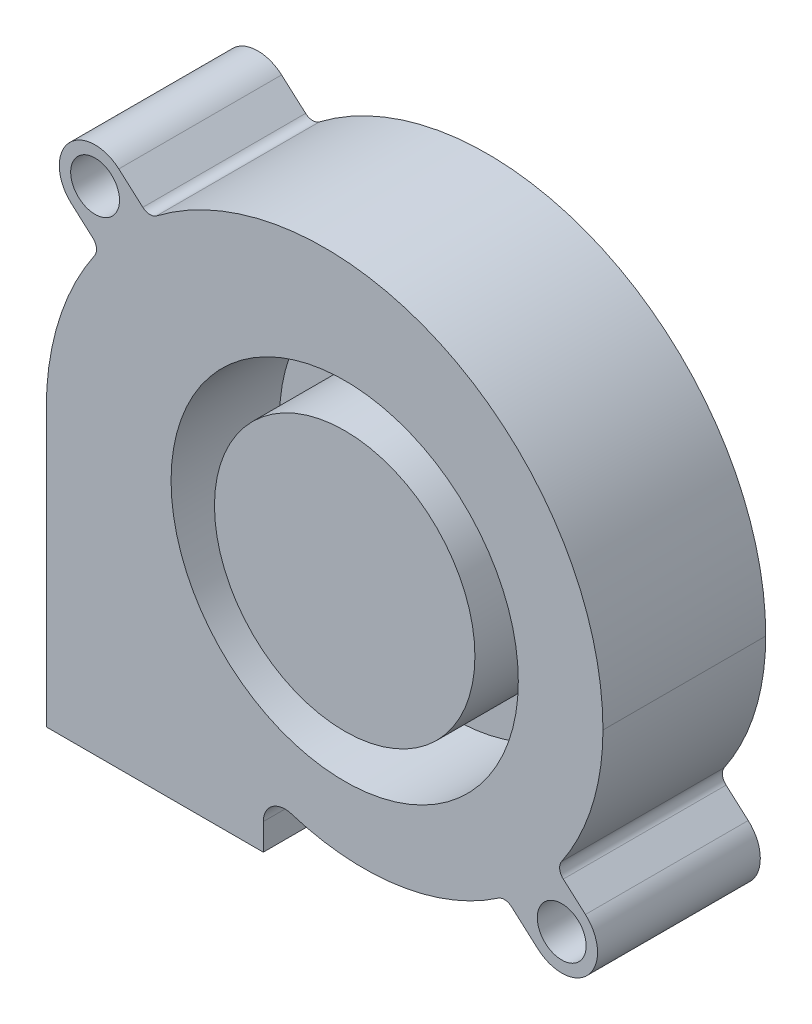
ISO-10303-21;
HEADER;
FILE_DESCRIPTION(('STEP AP214'),'2;1');
FILE_NAME('part.step','',(''),(''),'','','');
FILE_SCHEMA(('AUTOMOTIVE_DESIGN { 1 0 10303 214 1 1 1 1 }'));
ENDSEC;
DATA;
#1=APPLICATION_CONTEXT('core data for automotive mechanical design processes');
#2=APPLICATION_PROTOCOL_DEFINITION('international standard','automotive_design',2000,#1);
#3=PRODUCT_CONTEXT('',#1,'mechanical');
#4=PRODUCT('Part','Part','',(#3));
#5=PRODUCT_RELATED_PRODUCT_CATEGORY('part','',(#4));
#6=PRODUCT_DEFINITION_FORMATION('','',#4);
#7=PRODUCT_DEFINITION_CONTEXT('part definition',#1,'design');
#8=PRODUCT_DEFINITION('design','',#6,#7);
#9=PRODUCT_DEFINITION_SHAPE('','',#8);
#10=(LENGTH_UNIT() NAMED_UNIT(*) SI_UNIT(.MILLI.,.METRE.));
#11=(NAMED_UNIT(*) PLANE_ANGLE_UNIT() SI_UNIT($,.RADIAN.));
#12=(NAMED_UNIT(*) SI_UNIT($,.STERADIAN.) SOLID_ANGLE_UNIT());
#13=UNCERTAINTY_MEASURE_WITH_UNIT(LENGTH_MEASURE(1.E-05),#10,'distance_accuracy_value','');
#14=(GEOMETRIC_REPRESENTATION_CONTEXT(3) GLOBAL_UNCERTAINTY_ASSIGNED_CONTEXT((#13)) GLOBAL_UNIT_ASSIGNED_CONTEXT((#10,
#11,#12)) REPRESENTATION_CONTEXT('',''));
#15=CARTESIAN_POINT('',(0.,0.,0.));
#16=DIRECTION('',(0.,0.,1.));
#17=DIRECTION('',(1.,0.,0.));
#18=AXIS2_PLACEMENT_3D('',#15,#16,#17);
#19=CARTESIAN_POINT('',(-1.85000000000355,0.,15.));
#20=DIRECTION('',(0.,0.,-1.));
#21=DIRECTION('',(-1.,0.,0.));
#22=AXIS2_PLACEMENT_3D('',#19,#20,#21);
#23=PLANE('',#22);
#24=CARTESIAN_POINT('',(0.,0.,15.));
#25=DIRECTION('',(0.,0.,1.));
#26=DIRECTION('',(1.,0.,0.));
#27=AXIS2_PLACEMENT_3D('',#24,#25,#26);
#28=CIRCLE('',#27,16.);
#29=CARTESIAN_POINT('',(16.,0.,15.));
#30=VERTEX_POINT('',#29);
#31=EDGE_CURVE('E371',#30,#30,#28,.T.);
#32=ORIENTED_EDGE('',*,*,#31,.F.);
#33=EDGE_LOOP('',(#32));
#34=FACE_BOUND('',#33,.T.);
#35=DIRECTION('',(0.,1.,0.));
#36=VECTOR('',#35,1.);
#37=CARTESIAN_POINT('',(-7.50000000000078,-22.9558491109221,15.));
#38=LINE('',#37,#36);
#39=CARTESIAN_POINT('',(-7.50000000000078,-25.4,15.));
#40=VERTEX_POINT('',#39);
#41=CARTESIAN_POINT('',(-7.50000000000078,-22.9558491109221,15.));
#42=VERTEX_POINT('',#41);
#43=EDGE_CURVE('E235',#40,#42,#38,.T.);
#44=ORIENTED_EDGE('',*,*,#43,.T.);
#45=CARTESIAN_POINT('',(-5.50000000000078,-22.9558491109221,15.));
#46=DIRECTION('',(0.,0.,-1.));
#47=DIRECTION('',(1.,0.,0.));
#48=AXIS2_PLACEMENT_3D('',#45,#46,#47);
#49=CIRCLE('',#48,2.);
#50=CARTESIAN_POINT('',(-4.89904332949325,-21.0482718306599,15.));
#51=VERTEX_POINT('',#50);
#52=EDGE_CURVE('E133',#42,#51,#49,.T.);
#53=ORIENTED_EDGE('',*,*,#52,.T.);
#54=CARTESIAN_POINT('',(1.73193277310968,-6.89930076638998E-12,15.));
#55=DIRECTION('',(0.,0.,1.));
#56=DIRECTION('',(1.,0.,0.));
#57=AXIS2_PLACEMENT_3D('',#54,#55,#56);
#58=CIRCLE('',#57,22.0680672268858);
#59=CARTESIAN_POINT('',(14.1519761168158,-18.2412202023621,15.));
#60=VERTEX_POINT('',#59);
#61=EDGE_CURVE('E280',#51,#60,#58,.T.);
#62=ORIENTED_EDGE('',*,*,#61,.T.);
#63=CARTESIAN_POINT('',(14.714782239165,-19.067809138077,15.));
#64=DIRECTION('',(0.,0.,-1.));
#65=DIRECTION('',(-1.,0.,0.));
#66=AXIS2_PLACEMENT_3D('',#63,#64,#65);
#67=CIRCLE('',#66,1.);
#68=CARTESIAN_POINT('',(15.3769800356368,-18.3184800525958,15.));
#69=VERTEX_POINT('',#68);
#70=EDGE_CURVE('E299',#60,#69,#67,.T.);
#71=ORIENTED_EDGE('',*,*,#70,.T.);
#72=DIRECTION('',(0.749329085481126,-0.662197796471733,0.));
#73=VECTOR('',#72,1.);
#74=CARTESIAN_POINT('',(15.3769800356368,-18.3184800525958,15.));
#75=LINE('',#74,#73);
#76=CARTESIAN_POINT('',(17.8147472716426,-20.4727859820895,15.));
#77=VERTEX_POINT('',#76);
#78=EDGE_CURVE('E296',#69,#77,#75,.T.);
#79=ORIENTED_EDGE('',*,*,#78,.T.);
#80=CARTESIAN_POINT('',(19.9999999999992,-18.0000000000018,15.));
#81=DIRECTION('',(0.,0.,1.));
#82=DIRECTION('',(1.,0.,0.));
#83=AXIS2_PLACEMENT_3D('',#80,#81,#82);
#84=CIRCLE('',#83,3.29999999999989);
#85=CARTESIAN_POINT('',(22.1852527283558,-15.5272140179142,15.));
#86=VERTEX_POINT('',#85);
#87=EDGE_CURVE('E298',#77,#86,#84,.T.);
#88=ORIENTED_EDGE('',*,*,#87,.T.);
#89=DIRECTION('',(-0.749329085481141,0.662197796471717,0.));
#90=VECTOR('',#89,1.);
#91=CARTESIAN_POINT('',(20.1437347075857,-13.7230818135126,15.));
#92=LINE('',#91,#90);
#93=CARTESIAN_POINT('',(20.1437347075857,-13.7230818135126,15.));
#94=VERTEX_POINT('',#93);
#95=EDGE_CURVE('E301',#86,#94,#92,.T.);
#96=ORIENTED_EDGE('',*,*,#95,.T.);
#97=CARTESIAN_POINT('',(20.806916189271,-12.9736292485229,15.));
#98=DIRECTION('',(0.,0.,-1.));
#99=DIRECTION('',(-1.,0.,0.));
#100=AXIS2_PLACEMENT_3D('',#97,#98,#99);
#101=CIRCLE('',#100,1.00074413554114);
#102=CARTESIAN_POINT('',(19.9790752063325,-12.4113409489936,15.));
#103=VERTEX_POINT('',#102);
#104=EDGE_CURVE('E307',#94,#103,#101,.T.);
#105=ORIENTED_EDGE('',*,*,#104,.T.);
#106=CARTESIAN_POINT('',(1.68489135400954,0.0144820551859268,15.));
#107=DIRECTION('',(0.,0.,1.));
#108=DIRECTION('',(1.,0.,0.));
#109=AXIS2_PLACEMENT_3D('',#106,#107,#108);
#110=CIRCLE('',#109,22.115113387767);
#111=CARTESIAN_POINT('',(23.7999999999978,8.58046069634501E-12,15.));
#112=VERTEX_POINT('',#111);
#113=EDGE_CURVE('E309',#103,#112,#110,.T.);
#114=ORIENTED_EDGE('',*,*,#113,.T.);
#115=CARTESIAN_POINT('',(-1.8500000000022,0.0167968749980125,15.));
#116=DIRECTION('',(0.,0.,1.));
#117=DIRECTION('',(1.,0.,0.));
#118=AXIS2_PLACEMENT_3D('',#115,#116,#117);
#119=CIRCLE('',#118,25.6500054997072);
#120=CARTESIAN_POINT('',(-17.3330789029861,20.4666636183044,15.));
#121=VERTEX_POINT('',#120);
#122=EDGE_CURVE('E311',#112,#121,#119,.T.);
#123=ORIENTED_EDGE('',*,*,#122,.T.);
#124=CARTESIAN_POINT('',(-17.936707580694,21.2639292073329,15.));
#125=DIRECTION('',(0.,0.,-1.));
#126=DIRECTION('',(1.,0.,0.));
#127=AXIS2_PLACEMENT_3D('',#124,#125,#126);
#128=CIRCLE('',#127,1.00000000000021);
#129=CARTESIAN_POINT('',(-18.5989053771652,20.5146001218513,15.));
#130=VERTEX_POINT('',#129);
#131=EDGE_CURVE('E313',#121,#130,#128,.T.);
#132=ORIENTED_EDGE('',*,*,#131,.T.);
#133=DIRECTION('',(-0.749329085481529,0.662197796471278,0.));
#134=VECTOR('',#133,1.);
#135=CARTESIAN_POINT('',(-20.8147472716449,22.4727859820869,15.));
#136=LINE('',#135,#134);
#137=CARTESIAN_POINT('',(-20.8147472716449,22.4727859820869,15.));
#138=VERTEX_POINT('',#137);
#139=EDGE_CURVE('E315',#130,#138,#136,.T.);
#140=ORIENTED_EDGE('',*,*,#139,.T.);
#141=CARTESIAN_POINT('',(-23.,19.999999999998,15.));
#142=DIRECTION('',(0.,0.,1.));
#143=DIRECTION('',(1.,0.,0.));
#144=AXIS2_PLACEMENT_3D('',#141,#142,#143);
#145=CIRCLE('',#144,3.2999999999999);
#146=CARTESIAN_POINT('',(-25.1969221937562,17.5375758134327,15.));
#147=VERTEX_POINT('',#146);
#148=EDGE_CURVE('E317',#138,#147,#145,.T.);
#149=ORIENTED_EDGE('',*,*,#148,.T.);
#150=DIRECTION('',(0.746189147444025,-0.665733998107923,0.));
#151=VECTOR('',#150,1.);
#152=CARTESIAN_POINT('',(-25.1969221937562,17.5375758134327,15.));
#153=LINE('',#152,#151);
#154=CARTESIAN_POINT('',(-23.2033449780937,15.7589488595752,15.));
#155=VERTEX_POINT('',#154);
#156=EDGE_CURVE('E319',#147,#155,#153,.T.);
#157=ORIENTED_EDGE('',*,*,#156,.T.);
#158=CARTESIAN_POINT('',(-23.8690789762016,15.0127597121312,15.));
#159=DIRECTION('',(0.,0.,-1.));
#160=DIRECTION('',(-1.,0.,0.));
#161=AXIS2_PLACEMENT_3D('',#158,#159,#160);
#162=CIRCLE('',#161,0.999999999999994);
#163=CARTESIAN_POINT('',(-23.0428472901915,14.4494292575729,15.));
#164=VERTEX_POINT('',#163);
#165=EDGE_CURVE('E182',#155,#164,#162,.T.);
#166=ORIENTED_EDGE('',*,*,#165,.T.);
#167=CARTESIAN_POINT('',(-1.85000000000355,0.,15.));
#168=DIRECTION('',(0.,0.,1.));
#169=DIRECTION('',(-1.,0.,0.));
#170=AXIS2_PLACEMENT_3D('',#167,#168,#169);
#171=CIRCLE('',#170,25.6500054997037);
#172=CARTESIAN_POINT('',(-27.5000054997073,0.,15.));
#173=VERTEX_POINT('',#172);
#174=EDGE_CURVE('E176',#164,#173,#171,.T.);
#175=ORIENTED_EDGE('',*,*,#174,.T.);
#176=DIRECTION('',(0.,-1.,0.));
#177=VECTOR('',#176,1.);
#178=CARTESIAN_POINT('',(-27.5000054997073,-25.4,15.));
#179=LINE('',#178,#177);
#180=CARTESIAN_POINT('',(-27.5000054997073,-25.4,15.));
#181=VERTEX_POINT('',#180);
#182=EDGE_CURVE('E180',#173,#181,#179,.T.);
#183=ORIENTED_EDGE('',*,*,#182,.T.);
#184=DIRECTION('',(1.,0.,0.));
#185=VECTOR('',#184,1.);
#186=CARTESIAN_POINT('',(-7.50000000000078,-25.4,15.));
#187=LINE('',#186,#185);
#188=EDGE_CURVE('E60',#181,#40,#187,.T.);
#189=ORIENTED_EDGE('',*,*,#188,.T.);
#190=EDGE_LOOP('',(#44,#53,#62,#71,#79,#88,#96,#105,#114,#123,#132,#140,#149,#157,#166,#175,
#183,#189));
#191=FACE_BOUND('',#190,.T.);
#192=CARTESIAN_POINT('',(-23.,19.999999999998,15.));
#193=DIRECTION('',(0.,0.,1.));
#194=DIRECTION('',(1.,0.,0.));
#195=AXIS2_PLACEMENT_3D('',#192,#193,#194);
#196=CIRCLE('',#195,2.2500000000006);
#197=CARTESIAN_POINT('',(-20.7499999999994,19.999999999998,15.));
#198=VERTEX_POINT('',#197);
#199=EDGE_CURVE('E204',#198,#198,#196,.T.);
#200=ORIENTED_EDGE('',*,*,#199,.F.);
#201=EDGE_LOOP('',(#200));
#202=FACE_BOUND('',#201,.T.);
#203=CARTESIAN_POINT('',(19.9999999999992,-18.0000000000018,15.));
#204=DIRECTION('',(0.,0.,1.));
#205=DIRECTION('',(1.,0.,0.));
#206=AXIS2_PLACEMENT_3D('',#203,#204,#205);
#207=CIRCLE('',#206,2.25000000000129);
#208=CARTESIAN_POINT('',(22.2500000000005,-18.0000000000018,15.));
#209=VERTEX_POINT('',#208);
#210=EDGE_CURVE('E380',#209,#209,#207,.T.);
#211=ORIENTED_EDGE('',*,*,#210,.F.);
#212=EDGE_LOOP('',(#211));
#213=FACE_BOUND('',#212,.T.);
#214=ADVANCED_FACE('F43',(#34,#191,#202,#213),#23,.F.);
#215=CARTESIAN_POINT('',(-1.85000000000355,0.,0.));
#216=DIRECTION('',(0.,0.,-1.));
#217=DIRECTION('',(-1.,0.,0.));
#218=AXIS2_PLACEMENT_3D('',#215,#216,#217);
#219=PLANE('',#218);
#220=CARTESIAN_POINT('',(-23.,19.999999999998,0.));
#221=DIRECTION('',(0.,0.,1.));
#222=DIRECTION('',(1.,0.,0.));
#223=AXIS2_PLACEMENT_3D('',#220,#221,#222);
#224=CIRCLE('',#223,2.2500000000006);
#225=CARTESIAN_POINT('',(-20.7499999999994,19.999999999998,0.));
#226=VERTEX_POINT('',#225);
#227=EDGE_CURVE('E383',#226,#226,#224,.T.);
#228=ORIENTED_EDGE('',*,*,#227,.T.);
#229=EDGE_LOOP('',(#228));
#230=FACE_BOUND('',#229,.T.);
#231=DIRECTION('',(0.,1.,0.));
#232=VECTOR('',#231,1.);
#233=CARTESIAN_POINT('',(-7.50000000000078,-22.9558491109221,0.));
#234=LINE('',#233,#232);
#235=CARTESIAN_POINT('',(-7.50000000000078,-25.4,0.));
#236=VERTEX_POINT('',#235);
#237=CARTESIAN_POINT('',(-7.50000000000078,-22.9558491109221,0.));
#238=VERTEX_POINT('',#237);
#239=EDGE_CURVE('E200',#236,#238,#234,.T.);
#240=ORIENTED_EDGE('',*,*,#239,.F.);
#241=DIRECTION('',(1.,0.,0.));
#242=VECTOR('',#241,1.);
#243=CARTESIAN_POINT('',(-7.50000000000078,-25.4,0.));
#244=LINE('',#243,#242);
#245=CARTESIAN_POINT('',(-27.5000054997073,-25.4,0.));
#246=VERTEX_POINT('',#245);
#247=EDGE_CURVE('E125',#246,#236,#244,.T.);
#248=ORIENTED_EDGE('',*,*,#247,.F.);
#249=DIRECTION('',(0.,-1.,0.));
#250=VECTOR('',#249,1.);
#251=CARTESIAN_POINT('',(-27.5000054997073,-25.4,0.));
#252=LINE('',#251,#250);
#253=CARTESIAN_POINT('',(-27.5000054997073,0.,0.));
#254=VERTEX_POINT('',#253);
#255=EDGE_CURVE('E119',#254,#246,#252,.T.);
#256=ORIENTED_EDGE('',*,*,#255,.F.);
#257=CARTESIAN_POINT('',(-1.85000000000355,0.,0.));
#258=DIRECTION('',(0.,0.,1.));
#259=DIRECTION('',(-1.,0.,0.));
#260=AXIS2_PLACEMENT_3D('',#257,#258,#259);
#261=CIRCLE('',#260,25.6500054997037);
#262=CARTESIAN_POINT('',(-23.0428472901915,14.4494292575729,0.));
#263=VERTEX_POINT('',#262);
#264=EDGE_CURVE('E190',#263,#254,#261,.T.);
#265=ORIENTED_EDGE('',*,*,#264,.F.);
#266=CARTESIAN_POINT('',(-23.8690789762016,15.0127597121312,0.));
#267=DIRECTION('',(0.,0.,-1.));
#268=DIRECTION('',(-1.,0.,0.));
#269=AXIS2_PLACEMENT_3D('',#266,#267,#268);
#270=CIRCLE('',#269,0.999999999999994);
#271=CARTESIAN_POINT('',(-23.2033449780937,15.7589488595752,0.));
#272=VERTEX_POINT('',#271);
#273=EDGE_CURVE('E230',#272,#263,#270,.T.);
#274=ORIENTED_EDGE('',*,*,#273,.F.);
#275=DIRECTION('',(0.746189147444025,-0.665733998107923,0.));
#276=VECTOR('',#275,1.);
#277=CARTESIAN_POINT('',(-25.1969221937562,17.5375758134327,0.));
#278=LINE('',#277,#276);
#279=CARTESIAN_POINT('',(-25.1969221937562,17.5375758134327,0.));
#280=VERTEX_POINT('',#279);
#281=EDGE_CURVE('E228',#280,#272,#278,.T.);
#282=ORIENTED_EDGE('',*,*,#281,.F.);
#283=CARTESIAN_POINT('',(-23.,19.999999999998,0.));
#284=DIRECTION('',(0.,0.,1.));
#285=DIRECTION('',(1.,0.,0.));
#286=AXIS2_PLACEMENT_3D('',#283,#284,#285);
#287=CIRCLE('',#286,3.2999999999999);
#288=CARTESIAN_POINT('',(-20.8147472716449,22.4727859820869,0.));
#289=VERTEX_POINT('',#288);
#290=EDGE_CURVE('E226',#289,#280,#287,.T.);
#291=ORIENTED_EDGE('',*,*,#290,.F.);
#292=DIRECTION('',(-0.749329085481529,0.662197796471278,0.));
#293=VECTOR('',#292,1.);
#294=CARTESIAN_POINT('',(-20.8147472716449,22.4727859820869,0.));
#295=LINE('',#294,#293);
#296=CARTESIAN_POINT('',(-18.5989053771652,20.5146001218513,0.));
#297=VERTEX_POINT('',#296);
#298=EDGE_CURVE('E224',#297,#289,#295,.T.);
#299=ORIENTED_EDGE('',*,*,#298,.F.);
#300=CARTESIAN_POINT('',(-17.936707580694,21.2639292073329,0.));
#301=DIRECTION('',(0.,0.,-1.));
#302=DIRECTION('',(1.,0.,0.));
#303=AXIS2_PLACEMENT_3D('',#300,#301,#302);
#304=CIRCLE('',#303,1.00000000000021);
#305=CARTESIAN_POINT('',(-17.3330789029861,20.4666636183044,0.));
#306=VERTEX_POINT('',#305);
#307=EDGE_CURVE('E222',#306,#297,#304,.T.);
#308=ORIENTED_EDGE('',*,*,#307,.F.);
#309=CARTESIAN_POINT('',(-1.8500000000022,0.0167968749980125,0.));
#310=DIRECTION('',(0.,0.,1.));
#311=DIRECTION('',(1.,0.,0.));
#312=AXIS2_PLACEMENT_3D('',#309,#310,#311);
#313=CIRCLE('',#312,25.6500054997072);
#314=CARTESIAN_POINT('',(23.7999999999978,8.58046069634501E-12,0.));
#315=VERTEX_POINT('',#314);
#316=EDGE_CURVE('E220',#315,#306,#313,.T.);
#317=ORIENTED_EDGE('',*,*,#316,.F.);
#318=CARTESIAN_POINT('',(1.68489135400954,0.0144820551859268,0.));
#319=DIRECTION('',(0.,0.,1.));
#320=DIRECTION('',(1.,0.,0.));
#321=AXIS2_PLACEMENT_3D('',#318,#319,#320);
#322=CIRCLE('',#321,22.115113387767);
#323=CARTESIAN_POINT('',(19.9790752063325,-12.4113409489936,0.));
#324=VERTEX_POINT('',#323);
#325=EDGE_CURVE('E218',#324,#315,#322,.T.);
#326=ORIENTED_EDGE('',*,*,#325,.F.);
#327=CARTESIAN_POINT('',(20.806916189271,-12.9736292485229,0.));
#328=DIRECTION('',(0.,0.,-1.));
#329=DIRECTION('',(-1.,0.,0.));
#330=AXIS2_PLACEMENT_3D('',#327,#328,#329);
#331=CIRCLE('',#330,1.00074413554114);
#332=CARTESIAN_POINT('',(20.1437347075857,-13.7230818135126,0.));
#333=VERTEX_POINT('',#332);
#334=EDGE_CURVE('E216',#333,#324,#331,.T.);
#335=ORIENTED_EDGE('',*,*,#334,.F.);
#336=DIRECTION('',(-0.749329085481141,0.662197796471717,0.));
#337=VECTOR('',#336,1.);
#338=CARTESIAN_POINT('',(20.1437347075857,-13.7230818135126,0.));
#339=LINE('',#338,#337);
#340=CARTESIAN_POINT('',(22.1852527283558,-15.5272140179142,0.));
#341=VERTEX_POINT('',#340);
#342=EDGE_CURVE('E214',#341,#333,#339,.T.);
#343=ORIENTED_EDGE('',*,*,#342,.F.);
#344=CARTESIAN_POINT('',(19.9999999999992,-18.0000000000018,0.));
#345=DIRECTION('',(0.,0.,1.));
#346=DIRECTION('',(1.,0.,0.));
#347=AXIS2_PLACEMENT_3D('',#344,#345,#346);
#348=CIRCLE('',#347,3.29999999999989);
#349=CARTESIAN_POINT('',(17.8147472716426,-20.4727859820895,0.));
#350=VERTEX_POINT('',#349);
#351=EDGE_CURVE('E212',#350,#341,#348,.T.);
#352=ORIENTED_EDGE('',*,*,#351,.F.);
#353=DIRECTION('',(0.749329085481126,-0.662197796471733,0.));
#354=VECTOR('',#353,1.);
#355=CARTESIAN_POINT('',(15.3769800356368,-18.3184800525958,0.));
#356=LINE('',#355,#354);
#357=CARTESIAN_POINT('',(15.3769800356368,-18.3184800525958,0.));
#358=VERTEX_POINT('',#357);
#359=EDGE_CURVE('E210',#358,#350,#356,.T.);
#360=ORIENTED_EDGE('',*,*,#359,.F.);
#361=CARTESIAN_POINT('',(14.714782239165,-19.067809138077,0.));
#362=DIRECTION('',(0.,0.,-1.));
#363=DIRECTION('',(-1.,0.,0.));
#364=AXIS2_PLACEMENT_3D('',#361,#362,#363);
#365=CIRCLE('',#364,1.);
#366=CARTESIAN_POINT('',(14.1519761168158,-18.2412202023621,0.));
#367=VERTEX_POINT('',#366);
#368=EDGE_CURVE('E208',#367,#358,#365,.T.);
#369=ORIENTED_EDGE('',*,*,#368,.F.);
#370=CARTESIAN_POINT('',(1.73193277310968,-6.89930076638998E-12,0.));
#371=DIRECTION('',(0.,0.,1.));
#372=DIRECTION('',(1.,0.,0.));
#373=AXIS2_PLACEMENT_3D('',#370,#371,#372);
#374=CIRCLE('',#373,22.0680672268858);
#375=CARTESIAN_POINT('',(-4.89904332949325,-21.0482718306599,0.));
#376=VERTEX_POINT('',#375);
#377=EDGE_CURVE('E206',#376,#367,#374,.T.);
#378=ORIENTED_EDGE('',*,*,#377,.F.);
#379=CARTESIAN_POINT('',(-5.50000000000078,-22.9558491109221,0.));
#380=DIRECTION('',(0.,0.,-1.));
#381=DIRECTION('',(1.,0.,0.));
#382=AXIS2_PLACEMENT_3D('',#379,#380,#381);
#383=CIRCLE('',#382,2.);
#384=EDGE_CURVE('E203',#238,#376,#383,.T.);
#385=ORIENTED_EDGE('',*,*,#384,.F.);
#386=EDGE_LOOP('',(#240,#248,#256,#265,#274,#282,#291,#299,#308,#317,#326,#335,#343,#352,#360,
#369,#378,#385));
#387=FACE_BOUND('',#386,.T.);
#388=CARTESIAN_POINT('',(19.9999999999992,-18.0000000000018,0.));
#389=DIRECTION('',(0.,0.,1.));
#390=DIRECTION('',(1.,0.,0.));
#391=AXIS2_PLACEMENT_3D('',#388,#389,#390);
#392=CIRCLE('',#391,2.25000000000129);
#393=CARTESIAN_POINT('',(22.2500000000005,-18.0000000000018,0.));
#394=VERTEX_POINT('',#393);
#395=EDGE_CURVE('E377',#394,#394,#392,.T.);
#396=ORIENTED_EDGE('',*,*,#395,.T.);
#397=EDGE_LOOP('',(#396));
#398=FACE_BOUND('',#397,.T.);
#399=ADVANCED_FACE('F284',(#230,#387,#398),#219,.T.);
#400=CARTESIAN_POINT('',(-7.50000000000078,-22.9558491109221,15.));
#401=DIRECTION('',(-1.,0.,0.));
#402=DIRECTION('',(0.,0.,1.));
#403=AXIS2_PLACEMENT_3D('',#400,#401,#402);
#404=PLANE('',#403);
#405=ORIENTED_EDGE('',*,*,#239,.T.);
#406=DIRECTION('',(0.,0.,-1.));
#407=VECTOR('',#406,1.);
#408=CARTESIAN_POINT('',(-7.50000000000078,-22.9558491109221,15.));
#409=LINE('',#408,#407);
#410=EDGE_CURVE('E12',#42,#238,#409,.T.);
#411=ORIENTED_EDGE('',*,*,#410,.F.);
#412=ORIENTED_EDGE('',*,*,#43,.F.);
#413=DIRECTION('',(0.,0.,-1.));
#414=VECTOR('',#413,1.);
#415=CARTESIAN_POINT('',(-7.50000000000078,-25.4,15.));
#416=LINE('',#415,#414);
#417=EDGE_CURVE('E196',#40,#236,#416,.T.);
#418=ORIENTED_EDGE('',*,*,#417,.T.);
#419=EDGE_LOOP('',(#405,#411,#412,#418));
#420=FACE_BOUND('',#419,.T.);
#421=ADVANCED_FACE('F45',(#420),#404,.F.);
#422=CARTESIAN_POINT('',(-5.50000000000078,-22.9558491109221,15.));
#423=DIRECTION('',(0.,0.,-1.));
#424=DIRECTION('',(-1.,0.,0.));
#425=AXIS2_PLACEMENT_3D('',#422,#423,#424);
#426=CYLINDRICAL_SURFACE('',#425,2.);
#427=ORIENTED_EDGE('',*,*,#384,.T.);
#428=DIRECTION('',(0.,0.,-1.));
#429=VECTOR('',#428,1.);
#430=CARTESIAN_POINT('',(-4.89904332949325,-21.0482718306599,15.));
#431=LINE('',#430,#429);
#432=EDGE_CURVE('E52',#51,#376,#431,.T.);
#433=ORIENTED_EDGE('',*,*,#432,.F.);
#434=ORIENTED_EDGE('',*,*,#52,.F.);
#435=ORIENTED_EDGE('',*,*,#410,.T.);
#436=EDGE_LOOP('',(#427,#433,#434,#435));
#437=FACE_BOUND('',#436,.T.);
#438=ADVANCED_FACE('F586',(#437),#426,.F.);
#439=CARTESIAN_POINT('',(1.73193277310968,-6.89930076638998E-12,15.));
#440=DIRECTION('',(0.,0.,-1.));
#441=DIRECTION('',(-1.,0.,0.));
#442=AXIS2_PLACEMENT_3D('',#439,#440,#441);
#443=CYLINDRICAL_SURFACE('',#442,22.0680672268858);
#444=ORIENTED_EDGE('',*,*,#377,.T.);
#445=DIRECTION('',(0.,0.,-1.));
#446=VECTOR('',#445,1.);
#447=CARTESIAN_POINT('',(14.1519761168158,-18.2412202023621,15.));
#448=LINE('',#447,#446);
#449=EDGE_CURVE('E272',#60,#367,#448,.T.);
#450=ORIENTED_EDGE('',*,*,#449,.F.);
#451=ORIENTED_EDGE('',*,*,#61,.F.);
#452=ORIENTED_EDGE('',*,*,#432,.T.);
#453=EDGE_LOOP('',(#444,#450,#451,#452));
#454=FACE_BOUND('',#453,.T.);
#455=ADVANCED_FACE('F278',(#454),#443,.T.);
#456=CARTESIAN_POINT('',(14.714782239165,-19.067809138077,15.));
#457=DIRECTION('',(0.,0.,-1.));
#458=DIRECTION('',(-1.,0.,0.));
#459=AXIS2_PLACEMENT_3D('',#456,#457,#458);
#460=CYLINDRICAL_SURFACE('',#459,1.);
#461=ORIENTED_EDGE('',*,*,#368,.T.);
#462=DIRECTION('',(0.,0.,-1.));
#463=VECTOR('',#462,1.);
#464=CARTESIAN_POINT('',(15.3769800356368,-18.3184800525958,15.));
#465=LINE('',#464,#463);
#466=EDGE_CURVE('E269',#69,#358,#465,.T.);
#467=ORIENTED_EDGE('',*,*,#466,.F.);
#468=ORIENTED_EDGE('',*,*,#70,.F.);
#469=ORIENTED_EDGE('',*,*,#449,.T.);
#470=EDGE_LOOP('',(#461,#467,#468,#469));
#471=FACE_BOUND('',#470,.T.);
#472=ADVANCED_FACE('F290',(#471),#460,.F.);
#473=CARTESIAN_POINT('',(15.3769800356368,-18.3184800525958,15.));
#474=DIRECTION('',(0.662197796471733,0.749329085481126,0.));
#475=DIRECTION('',(-0.749329085481126,0.662197796471733,0.));
#476=AXIS2_PLACEMENT_3D('',#473,#474,#475);
#477=PLANE('',#476);
#478=ORIENTED_EDGE('',*,*,#359,.T.);
#479=DIRECTION('',(0.,0.,-1.));
#480=VECTOR('',#479,1.);
#481=CARTESIAN_POINT('',(17.8147472716426,-20.4727859820895,15.));
#482=LINE('',#481,#480);
#483=EDGE_CURVE('E266',#77,#350,#482,.T.);
#484=ORIENTED_EDGE('',*,*,#483,.F.);
#485=ORIENTED_EDGE('',*,*,#78,.F.);
#486=ORIENTED_EDGE('',*,*,#466,.T.);
#487=EDGE_LOOP('',(#478,#484,#485,#486));
#488=FACE_BOUND('',#487,.T.);
#489=ADVANCED_FACE('F294',(#488),#477,.F.);
#490=CARTESIAN_POINT('',(19.9999999999992,-18.0000000000018,15.));
#491=DIRECTION('',(0.,0.,-1.));
#492=DIRECTION('',(-1.,0.,0.));
#493=AXIS2_PLACEMENT_3D('',#490,#491,#492);
#494=CYLINDRICAL_SURFACE('',#493,3.29999999999989);
#495=ORIENTED_EDGE('',*,*,#351,.T.);
#496=DIRECTION('',(0.,0.,-1.));
#497=VECTOR('',#496,1.);
#498=CARTESIAN_POINT('',(22.1852527283558,-15.5272140179142,15.));
#499=LINE('',#498,#497);
#500=EDGE_CURVE('E263',#86,#341,#499,.T.);
#501=ORIENTED_EDGE('',*,*,#500,.F.);
#502=ORIENTED_EDGE('',*,*,#87,.F.);
#503=ORIENTED_EDGE('',*,*,#483,.T.);
#504=EDGE_LOOP('',(#495,#501,#502,#503));
#505=FACE_BOUND('',#504,.T.);
#506=ADVANCED_FACE('F551',(#505),#494,.T.);
#507=CARTESIAN_POINT('',(20.1437347075857,-13.7230818135126,15.));
#508=DIRECTION('',(-0.662197796471717,-0.749329085481141,0.));
#509=DIRECTION('',(0.749329085481141,-0.662197796471717,0.));
#510=AXIS2_PLACEMENT_3D('',#507,#508,#509);
#511=PLANE('',#510);
#512=ORIENTED_EDGE('',*,*,#342,.T.);
#513=DIRECTION('',(0.,0.,-1.));
#514=VECTOR('',#513,1.);
#515=CARTESIAN_POINT('',(20.1437347075857,-13.7230818135126,15.));
#516=LINE('',#515,#514);
#517=EDGE_CURVE('E260',#94,#333,#516,.T.);
#518=ORIENTED_EDGE('',*,*,#517,.F.);
#519=ORIENTED_EDGE('',*,*,#95,.F.);
#520=ORIENTED_EDGE('',*,*,#500,.T.);
#521=EDGE_LOOP('',(#512,#518,#519,#520));
#522=FACE_BOUND('',#521,.T.);
#523=ADVANCED_FACE('F541',(#522),#511,.F.);
#524=CARTESIAN_POINT('',(20.806916189271,-12.9736292485229,15.));
#525=DIRECTION('',(0.,0.,-1.));
#526=DIRECTION('',(-1.,0.,0.));
#527=AXIS2_PLACEMENT_3D('',#524,#525,#526);
#528=CYLINDRICAL_SURFACE('',#527,1.00074413554114);
#529=ORIENTED_EDGE('',*,*,#334,.T.);
#530=DIRECTION('',(0.,0.,-1.));
#531=VECTOR('',#530,1.);
#532=CARTESIAN_POINT('',(19.9790752063325,-12.4113409489936,15.));
#533=LINE('',#532,#531);
#534=EDGE_CURVE('E257',#103,#324,#533,.T.);
#535=ORIENTED_EDGE('',*,*,#534,.F.);
#536=ORIENTED_EDGE('',*,*,#104,.F.);
#537=ORIENTED_EDGE('',*,*,#517,.T.);
#538=EDGE_LOOP('',(#529,#535,#536,#537));
#539=FACE_BOUND('',#538,.T.);
#540=ADVANCED_FACE('F531',(#539),#528,.F.);
#541=CARTESIAN_POINT('',(1.68489135400954,0.0144820551859268,15.));
#542=DIRECTION('',(0.,0.,-1.));
#543=DIRECTION('',(-1.,0.,0.));
#544=AXIS2_PLACEMENT_3D('',#541,#542,#543);
#545=CYLINDRICAL_SURFACE('',#544,22.115113387767);
#546=ORIENTED_EDGE('',*,*,#325,.T.);
#547=DIRECTION('',(0.,0.,-1.));
#548=VECTOR('',#547,1.);
#549=CARTESIAN_POINT('',(23.7999999999978,8.58046069634501E-12,15.));
#550=LINE('',#549,#548);
#551=EDGE_CURVE('E254',#112,#315,#550,.T.);
#552=ORIENTED_EDGE('',*,*,#551,.F.);
#553=ORIENTED_EDGE('',*,*,#113,.F.);
#554=ORIENTED_EDGE('',*,*,#534,.T.);
#555=EDGE_LOOP('',(#546,#552,#553,#554));
#556=FACE_BOUND('',#555,.T.);
#557=ADVANCED_FACE('F521',(#556),#545,.T.);
#558=CARTESIAN_POINT('',(-1.8500000000022,0.0167968749980125,15.));
#559=DIRECTION('',(0.,0.,-1.));
#560=DIRECTION('',(-1.,0.,0.));
#561=AXIS2_PLACEMENT_3D('',#558,#559,#560);
#562=CYLINDRICAL_SURFACE('',#561,25.6500054997072);
#563=ORIENTED_EDGE('',*,*,#316,.T.);
#564=DIRECTION('',(0.,0.,-1.));
#565=VECTOR('',#564,1.);
#566=CARTESIAN_POINT('',(-17.3330789029861,20.4666636183044,15.));
#567=LINE('',#566,#565);
#568=EDGE_CURVE('E251',#121,#306,#567,.T.);
#569=ORIENTED_EDGE('',*,*,#568,.F.);
#570=ORIENTED_EDGE('',*,*,#122,.F.);
#571=ORIENTED_EDGE('',*,*,#551,.T.);
#572=EDGE_LOOP('',(#563,#569,#570,#571));
#573=FACE_BOUND('',#572,.T.);
#574=ADVANCED_FACE('F511',(#573),#562,.T.);
#575=CARTESIAN_POINT('',(-17.936707580694,21.2639292073329,15.));
#576=DIRECTION('',(0.,0.,-1.));
#577=DIRECTION('',(-1.,0.,0.));
#578=AXIS2_PLACEMENT_3D('',#575,#576,#577);
#579=CYLINDRICAL_SURFACE('',#578,1.00000000000021);
#580=ORIENTED_EDGE('',*,*,#307,.T.);
#581=DIRECTION('',(0.,0.,-1.));
#582=VECTOR('',#581,1.);
#583=CARTESIAN_POINT('',(-18.5989053771652,20.5146001218513,15.));
#584=LINE('',#583,#582);
#585=EDGE_CURVE('E248',#130,#297,#584,.T.);
#586=ORIENTED_EDGE('',*,*,#585,.F.);
#587=ORIENTED_EDGE('',*,*,#131,.F.);
#588=ORIENTED_EDGE('',*,*,#568,.T.);
#589=EDGE_LOOP('',(#580,#586,#587,#588));
#590=FACE_BOUND('',#589,.T.);
#591=ADVANCED_FACE('F501',(#590),#579,.F.);
#592=CARTESIAN_POINT('',(-20.8147472716449,22.4727859820869,15.));
#593=DIRECTION('',(-0.662197796471278,-0.749329085481529,0.));
#594=DIRECTION('',(0.749329085481529,-0.662197796471278,0.));
#595=AXIS2_PLACEMENT_3D('',#592,#593,#594);
#596=PLANE('',#595);
#597=ORIENTED_EDGE('',*,*,#298,.T.);
#598=DIRECTION('',(0.,0.,-1.));
#599=VECTOR('',#598,1.);
#600=CARTESIAN_POINT('',(-20.8147472716449,22.4727859820869,15.));
#601=LINE('',#600,#599);
#602=EDGE_CURVE('E245',#138,#289,#601,.T.);
#603=ORIENTED_EDGE('',*,*,#602,.F.);
#604=ORIENTED_EDGE('',*,*,#139,.F.);
#605=ORIENTED_EDGE('',*,*,#585,.T.);
#606=EDGE_LOOP('',(#597,#603,#604,#605));
#607=FACE_BOUND('',#606,.T.);
#608=ADVANCED_FACE('F491',(#607),#596,.F.);
#609=CARTESIAN_POINT('',(-23.,19.999999999998,15.));
#610=DIRECTION('',(0.,0.,-1.));
#611=DIRECTION('',(-1.,0.,0.));
#612=AXIS2_PLACEMENT_3D('',#609,#610,#611);
#613=CYLINDRICAL_SURFACE('',#612,3.2999999999999);
#614=ORIENTED_EDGE('',*,*,#290,.T.);
#615=DIRECTION('',(0.,0.,-1.));
#616=VECTOR('',#615,1.);
#617=CARTESIAN_POINT('',(-25.1969221937562,17.5375758134327,15.));
#618=LINE('',#617,#616);
#619=EDGE_CURVE('E242',#147,#280,#618,.T.);
#620=ORIENTED_EDGE('',*,*,#619,.F.);
#621=ORIENTED_EDGE('',*,*,#148,.F.);
#622=ORIENTED_EDGE('',*,*,#602,.T.);
#623=EDGE_LOOP('',(#614,#620,#621,#622));
#624=FACE_BOUND('',#623,.T.);
#625=ADVANCED_FACE('F482',(#624),#613,.T.);
#626=CARTESIAN_POINT('',(-25.1969221937562,17.5375758134327,15.));
#627=DIRECTION('',(0.665733998107923,0.746189147444025,0.));
#628=DIRECTION('',(-0.746189147444025,0.665733998107923,0.));
#629=AXIS2_PLACEMENT_3D('',#626,#627,#628);
#630=PLANE('',#629);
#631=ORIENTED_EDGE('',*,*,#281,.T.);
#632=DIRECTION('',(0.,0.,-1.));
#633=VECTOR('',#632,1.);
#634=CARTESIAN_POINT('',(-23.2033449780937,15.7589488595752,15.));
#635=LINE('',#634,#633);
#636=EDGE_CURVE('E239',#155,#272,#635,.T.);
#637=ORIENTED_EDGE('',*,*,#636,.F.);
#638=ORIENTED_EDGE('',*,*,#156,.F.);
#639=ORIENTED_EDGE('',*,*,#619,.T.);
#640=EDGE_LOOP('',(#631,#637,#638,#639));
#641=FACE_BOUND('',#640,.T.);
#642=ADVANCED_FACE('F325',(#641),#630,.F.);
#643=CARTESIAN_POINT('',(-23.8690789762016,15.0127597121312,15.));
#644=DIRECTION('',(0.,0.,-1.));
#645=DIRECTION('',(-1.,0.,0.));
#646=AXIS2_PLACEMENT_3D('',#643,#644,#645);
#647=CYLINDRICAL_SURFACE('',#646,0.999999999999994);
#648=ORIENTED_EDGE('',*,*,#273,.T.);
#649=DIRECTION('',(0.,0.,-1.));
#650=VECTOR('',#649,1.);
#651=CARTESIAN_POINT('',(-23.0428472901915,14.4494292575729,15.));
#652=LINE('',#651,#650);
#653=EDGE_CURVE('E191',#164,#263,#652,.T.);
#654=ORIENTED_EDGE('',*,*,#653,.F.);
#655=ORIENTED_EDGE('',*,*,#165,.F.);
#656=ORIENTED_EDGE('',*,*,#636,.T.);
#657=EDGE_LOOP('',(#648,#654,#655,#656));
#658=FACE_BOUND('',#657,.T.);
#659=ADVANCED_FACE('F329',(#658),#647,.F.);
#660=CARTESIAN_POINT('',(-1.85000000000355,0.,15.));
#661=DIRECTION('',(0.,0.,-1.));
#662=DIRECTION('',(-1.,0.,0.));
#663=AXIS2_PLACEMENT_3D('',#660,#661,#662);
#664=CYLINDRICAL_SURFACE('',#663,25.6500054997037);
#665=ORIENTED_EDGE('',*,*,#264,.T.);
#666=DIRECTION('',(0.,0.,-1.));
#667=VECTOR('',#666,1.);
#668=CARTESIAN_POINT('',(-27.5000054997073,0.,15.));
#669=LINE('',#668,#667);
#670=EDGE_CURVE('E187',#173,#254,#669,.T.);
#671=ORIENTED_EDGE('',*,*,#670,.F.);
#672=ORIENTED_EDGE('',*,*,#174,.F.);
#673=ORIENTED_EDGE('',*,*,#653,.T.);
#674=EDGE_LOOP('',(#665,#671,#672,#673));
#675=FACE_BOUND('',#674,.T.);
#676=ADVANCED_FACE('F188',(#675),#664,.T.);
#677=CARTESIAN_POINT('',(-27.5000054997073,-25.4,15.));
#678=DIRECTION('',(1.,0.,0.));
#679=DIRECTION('',(0.,0.,-1.));
#680=AXIS2_PLACEMENT_3D('',#677,#678,#679);
#681=PLANE('',#680);
#682=ORIENTED_EDGE('',*,*,#255,.T.);
#683=DIRECTION('',(0.,0.,-1.));
#684=VECTOR('',#683,1.);
#685=CARTESIAN_POINT('',(-27.5000054997073,-25.4,15.));
#686=LINE('',#685,#684);
#687=EDGE_CURVE('E192',#181,#246,#686,.T.);
#688=ORIENTED_EDGE('',*,*,#687,.F.);
#689=ORIENTED_EDGE('',*,*,#182,.F.);
#690=ORIENTED_EDGE('',*,*,#670,.T.);
#691=EDGE_LOOP('',(#682,#688,#689,#690));
#692=FACE_BOUND('',#691,.T.);
#693=ADVANCED_FACE('F194',(#692),#681,.F.);
#694=CARTESIAN_POINT('',(-7.50000000000078,-25.4,15.));
#695=DIRECTION('',(0.,1.,0.));
#696=DIRECTION('',(-1.,0.,0.));
#697=AXIS2_PLACEMENT_3D('',#694,#695,#696);
#698=PLANE('',#697);
#699=ORIENTED_EDGE('',*,*,#247,.T.);
#700=ORIENTED_EDGE('',*,*,#417,.F.);
#701=ORIENTED_EDGE('',*,*,#188,.F.);
#702=ORIENTED_EDGE('',*,*,#687,.T.);
#703=EDGE_LOOP('',(#699,#700,#701,#702));
#704=FACE_BOUND('',#703,.T.);
#705=ADVANCED_FACE('F333',(#704),#698,.F.);
#706=CARTESIAN_POINT('',(-23.,19.999999999998,15.));
#707=DIRECTION('',(0.,0.,-1.));
#708=DIRECTION('',(-1.,0.,0.));
#709=AXIS2_PLACEMENT_3D('',#706,#707,#708);
#710=CYLINDRICAL_SURFACE('',#709,2.2500000000006);
#711=ORIENTED_EDGE('',*,*,#199,.T.);
#712=EDGE_LOOP('',(#711));
#713=FACE_BOUND('',#712,.T.);
#714=ORIENTED_EDGE('',*,*,#227,.F.);
#715=EDGE_LOOP('',(#714));
#716=FACE_BOUND('',#715,.T.);
#717=ADVANCED_FACE('F335',(#713,#716),#710,.F.);
#718=CARTESIAN_POINT('',(19.9999999999992,-18.0000000000018,15.));
#719=DIRECTION('',(0.,0.,-1.));
#720=DIRECTION('',(-1.,0.,0.));
#721=AXIS2_PLACEMENT_3D('',#718,#719,#720);
#722=CYLINDRICAL_SURFACE('',#721,2.25000000000129);
#723=ORIENTED_EDGE('',*,*,#210,.T.);
#724=EDGE_LOOP('',(#723));
#725=FACE_BOUND('',#724,.T.);
#726=ORIENTED_EDGE('',*,*,#395,.F.);
#727=EDGE_LOOP('',(#726));
#728=FACE_BOUND('',#727,.T.);
#729=ADVANCED_FACE('F341',(#725,#728),#722,.F.);
#730=CARTESIAN_POINT('',(0.,0.,5.));
#731=DIRECTION('',(0.,0.,1.));
#732=DIRECTION('',(1.,0.,0.));
#733=AXIS2_PLACEMENT_3D('',#730,#731,#732);
#734=CYLINDRICAL_SURFACE('',#733,16.);
#735=CARTESIAN_POINT('',(0.,0.,5.));
#736=DIRECTION('',(0.,0.,1.));
#737=DIRECTION('',(1.,0.,0.));
#738=AXIS2_PLACEMENT_3D('',#735,#736,#737);
#739=CIRCLE('',#738,16.);
#740=CARTESIAN_POINT('',(16.,0.,5.));
#741=VERTEX_POINT('',#740);
#742=EDGE_CURVE('E374',#741,#741,#739,.T.);
#743=ORIENTED_EDGE('',*,*,#742,.F.);
#744=EDGE_LOOP('',(#743));
#745=FACE_BOUND('',#744,.T.);
#746=ORIENTED_EDGE('',*,*,#31,.T.);
#747=EDGE_LOOP('',(#746));
#748=FACE_BOUND('',#747,.T.);
#749=ADVANCED_FACE('F399',(#745,#748),#734,.F.);
#750=CARTESIAN_POINT('',(0.,0.,5.));
#751=DIRECTION('',(0.,0.,1.));
#752=DIRECTION('',(1.,0.,0.));
#753=AXIS2_PLACEMENT_3D('',#750,#751,#752);
#754=PLANE('',#753);
#755=CARTESIAN_POINT('',(0.,0.,5.));
#756=DIRECTION('',(0.,0.,1.));
#757=DIRECTION('',(1.,0.,0.));
#758=AXIS2_PLACEMENT_3D('',#755,#756,#757);
#759=CIRCLE('',#758,12.);
#760=CARTESIAN_POINT('',(12.,0.,5.));
#761=VERTEX_POINT('',#760);
#762=EDGE_CURVE('E368',#761,#761,#759,.T.);
#763=ORIENTED_EDGE('',*,*,#762,.F.);
#764=EDGE_LOOP('',(#763));
#765=FACE_BOUND('',#764,.T.);
#766=ORIENTED_EDGE('',*,*,#742,.T.);
#767=EDGE_LOOP('',(#766));
#768=FACE_BOUND('',#767,.T.);
#769=ADVANCED_FACE('F361',(#765,#768),#754,.T.);
#770=CARTESIAN_POINT('',(0.,0.,5.));
#771=DIRECTION('',(0.,0.,1.));
#772=DIRECTION('',(1.,0.,0.));
#773=AXIS2_PLACEMENT_3D('',#770,#771,#772);
#774=CYLINDRICAL_SURFACE('',#773,12.);
#775=ORIENTED_EDGE('',*,*,#762,.T.);
#776=EDGE_LOOP('',(#775));
#777=FACE_BOUND('',#776,.T.);
#778=CARTESIAN_POINT('',(0.,0.,15.));
#779=DIRECTION('',(0.,0.,1.));
#780=DIRECTION('',(1.,0.,0.));
#781=AXIS2_PLACEMENT_3D('',#778,#779,#780);
#782=CIRCLE('',#781,12.);
#783=CARTESIAN_POINT('',(12.,0.,15.));
#784=VERTEX_POINT('',#783);
#785=EDGE_CURVE('E366',#784,#784,#782,.T.);
#786=ORIENTED_EDGE('',*,*,#785,.F.);
#787=EDGE_LOOP('',(#786));
#788=FACE_BOUND('',#787,.T.);
#789=ADVANCED_FACE('F356',(#777,#788),#774,.T.);
#790=ORIENTED_EDGE('',*,*,#785,.T.);
#791=EDGE_LOOP('',(#790));
#792=FACE_BOUND('',#791,.T.);
#793=ADVANCED_FACE('F349',(#792),#23,.F.);
#794=CLOSED_SHELL('',(#214,#399,#421,#438,#455,#472,#489,#506,#523,#540,#557,#574,#591,#608,
#625,#642,#659,#676,#693,#705,#717,#729,#749,#769,#789,#793));
#795=MANIFOLD_SOLID_BREP('B2',#794);
#796=ADVANCED_BREP_SHAPE_REPRESENTATION('',(#18,#795),#14);
#797=SHAPE_DEFINITION_REPRESENTATION(#9,#796);
ENDSEC;
END-ISO-10303-21;
